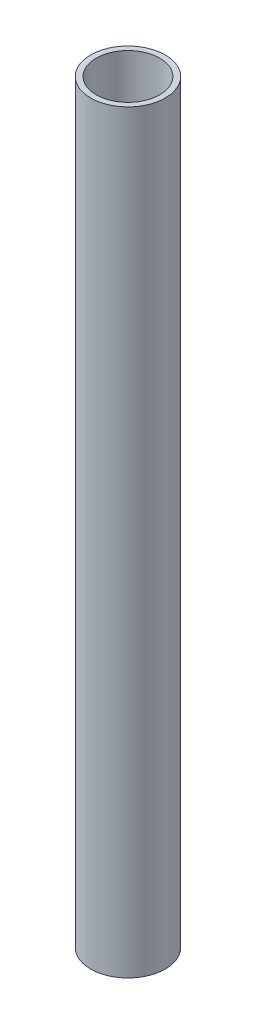
ISO-10303-21;
HEADER;
FILE_DESCRIPTION(('STEP AP214'),'2;1');
FILE_NAME('part.step','',(''),(''),'','','');
FILE_SCHEMA(('AUTOMOTIVE_DESIGN { 1 0 10303 214 1 1 1 1 }'));
ENDSEC;
DATA;
#1=APPLICATION_CONTEXT('core data for automotive mechanical design processes');
#2=APPLICATION_PROTOCOL_DEFINITION('international standard','automotive_design',2000,#1);
#3=PRODUCT_CONTEXT('',#1,'mechanical');
#4=PRODUCT('Part','Part','',(#3));
#5=PRODUCT_RELATED_PRODUCT_CATEGORY('part','',(#4));
#6=PRODUCT_DEFINITION_FORMATION('','',#4);
#7=PRODUCT_DEFINITION_CONTEXT('part definition',#1,'design');
#8=PRODUCT_DEFINITION('design','',#6,#7);
#9=PRODUCT_DEFINITION_SHAPE('','',#8);
#10=(LENGTH_UNIT() NAMED_UNIT(*) SI_UNIT(.MILLI.,.METRE.));
#11=(NAMED_UNIT(*) PLANE_ANGLE_UNIT() SI_UNIT($,.RADIAN.));
#12=(NAMED_UNIT(*) SI_UNIT($,.STERADIAN.) SOLID_ANGLE_UNIT());
#13=UNCERTAINTY_MEASURE_WITH_UNIT(LENGTH_MEASURE(1.E-05),#10,'distance_accuracy_value','');
#14=(GEOMETRIC_REPRESENTATION_CONTEXT(3) GLOBAL_UNCERTAINTY_ASSIGNED_CONTEXT((#13)) GLOBAL_UNIT_ASSIGNED_CONTEXT((#10,
#11,#12)) REPRESENTATION_CONTEXT('',''));
#15=CARTESIAN_POINT('',(0.,0.,0.));
#16=DIRECTION('',(0.,0.,1.));
#17=DIRECTION('',(1.,0.,0.));
#18=AXIS2_PLACEMENT_3D('',#15,#16,#17);
#19=CARTESIAN_POINT('',(0.,0.,0.));
#20=DIRECTION('',(0.,1.,0.));
#21=DIRECTION('',(0.,0.,1.));
#22=AXIS2_PLACEMENT_3D('',#19,#20,#21);
#23=CYLINDRICAL_SURFACE('',#22,13.5);
#24=CARTESIAN_POINT('',(0.,273.,0.));
#25=DIRECTION('',(0.,1.,0.));
#26=DIRECTION('',(0.,0.,1.));
#27=AXIS2_PLACEMENT_3D('',#24,#25,#26);
#28=CIRCLE('',#27,13.5);
#29=CARTESIAN_POINT('',(0.,273.,13.5));
#30=VERTEX_POINT('',#29);
#31=EDGE_CURVE('E51',#30,#30,#28,.T.);
#32=ORIENTED_EDGE('',*,*,#31,.F.);
#33=EDGE_LOOP('',(#32));
#34=FACE_BOUND('',#33,.T.);
#35=CARTESIAN_POINT('',(0.,0.,0.));
#36=DIRECTION('',(0.,1.,0.));
#37=DIRECTION('',(0.,0.,1.));
#38=AXIS2_PLACEMENT_3D('',#35,#36,#37);
#39=CIRCLE('',#38,13.5);
#40=CARTESIAN_POINT('',(0.,0.,13.5));
#41=VERTEX_POINT('',#40);
#42=EDGE_CURVE('E40',#41,#41,#39,.T.);
#43=ORIENTED_EDGE('',*,*,#42,.T.);
#44=EDGE_LOOP('',(#43));
#45=FACE_BOUND('',#44,.T.);
#46=ADVANCED_FACE('F37',(#34,#45),#23,.T.);
#47=CARTESIAN_POINT('',(0.,0.,0.));
#48=DIRECTION('',(0.,1.,0.));
#49=DIRECTION('',(0.,0.,1.));
#50=AXIS2_PLACEMENT_3D('',#47,#48,#49);
#51=PLANE('',#50);
#52=CARTESIAN_POINT('',(0.,0.,0.));
#53=DIRECTION('',(0.,1.,0.));
#54=DIRECTION('',(0.,0.,1.));
#55=AXIS2_PLACEMENT_3D('',#52,#53,#54);
#56=CIRCLE('',#55,11.5);
#57=CARTESIAN_POINT('',(0.,0.,11.5));
#58=VERTEX_POINT('',#57);
#59=EDGE_CURVE('E45',#58,#58,#56,.F.);
#60=ORIENTED_EDGE('',*,*,#59,.F.);
#61=EDGE_LOOP('',(#60));
#62=FACE_BOUND('',#61,.T.);
#63=ORIENTED_EDGE('',*,*,#42,.F.);
#64=EDGE_LOOP('',(#63));
#65=FACE_BOUND('',#64,.T.);
#66=ADVANCED_FACE('F62',(#62,#65),#51,.F.);
#67=CARTESIAN_POINT('',(0.,273.,0.));
#68=DIRECTION('',(0.,1.,0.));
#69=DIRECTION('',(0.,0.,1.));
#70=AXIS2_PLACEMENT_3D('',#67,#68,#69);
#71=PLANE('',#70);
#72=CARTESIAN_POINT('',(0.,273.,0.));
#73=DIRECTION('',(0.,1.,0.));
#74=DIRECTION('',(0.,0.,1.));
#75=AXIS2_PLACEMENT_3D('',#72,#73,#74);
#76=CIRCLE('',#75,11.5);
#77=CARTESIAN_POINT('',(0.,273.,11.5));
#78=VERTEX_POINT('',#77);
#79=EDGE_CURVE('E10',#78,#78,#76,.F.);
#80=ORIENTED_EDGE('',*,*,#79,.T.);
#81=EDGE_LOOP('',(#80));
#82=FACE_BOUND('',#81,.T.);
#83=ORIENTED_EDGE('',*,*,#31,.T.);
#84=EDGE_LOOP('',(#83));
#85=FACE_BOUND('',#84,.T.);
#86=ADVANCED_FACE('F64',(#82,#85),#71,.T.);
#87=CARTESIAN_POINT('',(0.,0.,0.));
#88=DIRECTION('',(0.,1.,0.));
#89=DIRECTION('',(0.,0.,1.));
#90=AXIS2_PLACEMENT_3D('',#87,#88,#89);
#91=CYLINDRICAL_SURFACE('',#90,11.5);
#92=ORIENTED_EDGE('',*,*,#79,.F.);
#93=EDGE_LOOP('',(#92));
#94=FACE_BOUND('',#93,.T.);
#95=ORIENTED_EDGE('',*,*,#59,.T.);
#96=EDGE_LOOP('',(#95));
#97=FACE_BOUND('',#96,.T.);
#98=ADVANCED_FACE('F70',(#94,#97),#91,.F.);
#99=CLOSED_SHELL('',(#46,#66,#86,#98));
#100=MANIFOLD_SOLID_BREP('B2',#99);
#101=ADVANCED_BREP_SHAPE_REPRESENTATION('',(#18,#100),#14);
#102=SHAPE_DEFINITION_REPRESENTATION(#9,#101);
ENDSEC;
END-ISO-10303-21;
